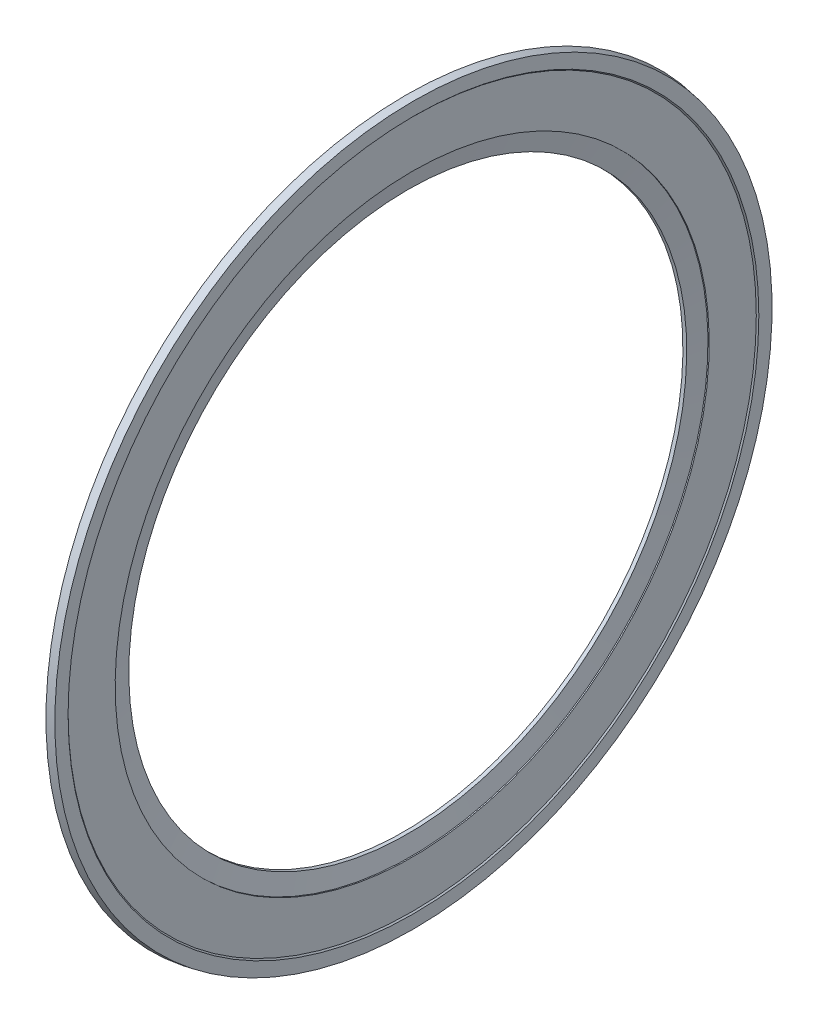
ISO-10303-21;
HEADER;
FILE_DESCRIPTION(('STEP AP214'),'2;1');
FILE_NAME('part.step','',(''),(''),'','','');
FILE_SCHEMA(('AUTOMOTIVE_DESIGN { 1 0 10303 214 1 1 1 1 }'));
ENDSEC;
DATA;
#1=APPLICATION_CONTEXT('core data for automotive mechanical design processes');
#2=APPLICATION_PROTOCOL_DEFINITION('international standard','automotive_design',2000,#1);
#3=PRODUCT_CONTEXT('',#1,'mechanical');
#4=PRODUCT('Part','Part','',(#3));
#5=PRODUCT_RELATED_PRODUCT_CATEGORY('part','',(#4));
#6=PRODUCT_DEFINITION_FORMATION('','',#4);
#7=PRODUCT_DEFINITION_CONTEXT('part definition',#1,'design');
#8=PRODUCT_DEFINITION('design','',#6,#7);
#9=PRODUCT_DEFINITION_SHAPE('','',#8);
#10=(LENGTH_UNIT() NAMED_UNIT(*) SI_UNIT(.MILLI.,.METRE.));
#11=(NAMED_UNIT(*) PLANE_ANGLE_UNIT() SI_UNIT($,.RADIAN.));
#12=(NAMED_UNIT(*) SI_UNIT($,.STERADIAN.) SOLID_ANGLE_UNIT());
#13=UNCERTAINTY_MEASURE_WITH_UNIT(LENGTH_MEASURE(1.E-05),#10,'distance_accuracy_value','');
#14=(GEOMETRIC_REPRESENTATION_CONTEXT(3) GLOBAL_UNCERTAINTY_ASSIGNED_CONTEXT((#13)) GLOBAL_UNIT_ASSIGNED_CONTEXT((#10,
#11,#12)) REPRESENTATION_CONTEXT('',''));
#15=CARTESIAN_POINT('',(0.,0.,0.));
#16=DIRECTION('',(0.,0.,1.));
#17=DIRECTION('',(1.,0.,0.));
#18=AXIS2_PLACEMENT_3D('',#15,#16,#17);
#19=CARTESIAN_POINT('',(0.17,11.9895505867204,0.));
#20=DIRECTION('',(-1.,0.,0.));
#21=DIRECTION('',(0.,-1.,0.));
#22=AXIS2_PLACEMENT_3D('',#19,#20,#21);
#23=PLANE('',#22);
#24=CARTESIAN_POINT('',(0.17,0.,0.));
#25=DIRECTION('',(1.,0.,0.));
#26=DIRECTION('',(0.,1.,0.));
#27=AXIS2_PLACEMENT_3D('',#24,#25,#26);
#28=CIRCLE('',#27,11.8620505867204);
#29=CARTESIAN_POINT('',(0.17,11.8620505867204,0.));
#30=VERTEX_POINT('',#29);
#31=EDGE_CURVE('E11',#30,#30,#28,.T.);
#32=ORIENTED_EDGE('',*,*,#31,.T.);
#33=EDGE_LOOP('',(#32));
#34=FACE_BOUND('',#33,.T.);
#35=CARTESIAN_POINT('',(0.17,0.,0.));
#36=DIRECTION('',(1.,0.,0.));
#37=DIRECTION('',(0.,1.,0.));
#38=AXIS2_PLACEMENT_3D('',#35,#36,#37);
#39=CIRCLE('',#38,12.1170505867204);
#40=CARTESIAN_POINT('',(0.17,12.1170505867204,0.));
#41=VERTEX_POINT('',#40);
#42=EDGE_CURVE('E80',#41,#41,#39,.T.);
#43=ORIENTED_EDGE('',*,*,#42,.F.);
#44=EDGE_LOOP('',(#43));
#45=FACE_BOUND('',#44,.T.);
#46=ADVANCED_FACE('F16',(#34,#45),#23,.T.);
#47=CARTESIAN_POINT('',(0.1275,0.,0.));
#48=DIRECTION('',(1.,0.,0.));
#49=DIRECTION('',(0.,1.,0.));
#50=AXIS2_PLACEMENT_3D('',#47,#48,#49);
#51=CONICAL_SURFACE('',#50,11.8195505867204,0.785398163397441);
#52=CARTESIAN_POINT('',(0.085,0.,0.));
#53=DIRECTION('',(1.,0.,0.));
#54=DIRECTION('',(0.,1.,0.));
#55=AXIS2_PLACEMENT_3D('',#52,#53,#54);
#56=CIRCLE('',#55,11.7770505867204);
#57=CARTESIAN_POINT('',(0.085,11.7770505867204,0.));
#58=VERTEX_POINT('',#57);
#59=EDGE_CURVE('E26',#58,#58,#56,.T.);
#60=ORIENTED_EDGE('',*,*,#59,.T.);
#61=EDGE_LOOP('',(#60));
#62=FACE_BOUND('',#61,.T.);
#63=ORIENTED_EDGE('',*,*,#31,.F.);
#64=EDGE_LOOP('',(#63));
#65=FACE_BOUND('',#64,.T.);
#66=ADVANCED_FACE('F103',(#62,#65),#51,.T.);
#67=CARTESIAN_POINT('',(0.085,10.8880252933602,0.));
#68=DIRECTION('',(-1.,0.,0.));
#69=DIRECTION('',(0.,-1.,0.));
#70=AXIS2_PLACEMENT_3D('',#67,#68,#69);
#71=PLANE('',#70);
#72=CARTESIAN_POINT('',(0.085,0.,0.));
#73=DIRECTION('',(1.,0.,0.));
#74=DIRECTION('',(0.,1.,0.));
#75=AXIS2_PLACEMENT_3D('',#72,#73,#74);
#76=CIRCLE('',#75,9.999);
#77=CARTESIAN_POINT('',(0.085,9.999,0.));
#78=VERTEX_POINT('',#77);
#79=EDGE_CURVE('E74',#78,#78,#76,.T.);
#80=ORIENTED_EDGE('',*,*,#79,.T.);
#81=EDGE_LOOP('',(#80));
#82=FACE_BOUND('',#81,.T.);
#83=ORIENTED_EDGE('',*,*,#59,.F.);
#84=EDGE_LOOP('',(#83));
#85=FACE_BOUND('',#84,.T.);
#86=ADVANCED_FACE('F88',(#82,#85),#71,.T.);
#87=CARTESIAN_POINT('',(0.143325944647351,0.,0.));
#88=DIRECTION('',(-1.,0.,0.));
#89=DIRECTION('',(0.,1.,0.));
#90=AXIS2_PLACEMENT_3D('',#87,#88,#89);
#91=CONICAL_SURFACE('',#90,9.96532550015711,0.523598775598287);
#92=CARTESIAN_POINT('',(0.201651889294703,0.,0.));
#93=DIRECTION('',(1.,0.,0.));
#94=DIRECTION('',(0.,1.,0.));
#95=AXIS2_PLACEMENT_3D('',#92,#93,#94);
#96=CIRCLE('',#95,9.93165100031423);
#97=CARTESIAN_POINT('',(0.201651889294703,9.93165100031423,0.));
#98=VERTEX_POINT('',#97);
#99=EDGE_CURVE('E76',#98,#98,#96,.T.);
#100=ORIENTED_EDGE('',*,*,#99,.T.);
#101=EDGE_LOOP('',(#100));
#102=FACE_BOUND('',#101,.T.);
#103=ORIENTED_EDGE('',*,*,#79,.F.);
#104=EDGE_LOOP('',(#103));
#105=FACE_BOUND('',#104,.T.);
#106=ADVANCED_FACE('F91',(#102,#105),#91,.F.);
#107=CARTESIAN_POINT('',(0.153950944647351,0.,0.));
#108=DIRECTION('',(1.,0.,0.));
#109=DIRECTION('',(0.,1.,0.));
#110=AXIS2_PLACEMENT_3D('',#107,#108,#109);
#111=CONICAL_SURFACE('',#110,9.66112550015711,1.39626340159546);
#112=CARTESIAN_POINT('',(0.10625,0.,0.));
#113=DIRECTION('',(1.,0.,0.));
#114=DIRECTION('',(0.,1.,0.));
#115=AXIS2_PLACEMENT_3D('',#112,#113,#114);
#116=CIRCLE('',#115,9.3906);
#117=CARTESIAN_POINT('',(0.10625,9.3906,0.));
#118=VERTEX_POINT('',#117);
#119=EDGE_CURVE('E69',#118,#118,#116,.T.);
#120=ORIENTED_EDGE('',*,*,#119,.T.);
#121=EDGE_LOOP('',(#120));
#122=FACE_BOUND('',#121,.T.);
#123=ORIENTED_EDGE('',*,*,#99,.F.);
#124=EDGE_LOOP('',(#123));
#125=FACE_BOUND('',#124,.T.);
#126=ADVANCED_FACE('F93',(#122,#125),#111,.T.);
#127=CARTESIAN_POINT('',(0.17,0.,0.));
#128=DIRECTION('',(-1.,0.,0.));
#129=DIRECTION('',(0.,1.,0.));
#130=AXIS2_PLACEMENT_3D('',#127,#128,#129);
#131=CYLINDRICAL_SURFACE('',#130,9.3906);
#132=CARTESIAN_POINT('',(0.23375,0.,0.));
#133=DIRECTION('',(1.,0.,0.));
#134=DIRECTION('',(0.,1.,0.));
#135=AXIS2_PLACEMENT_3D('',#132,#133,#134);
#136=CIRCLE('',#135,9.3906);
#137=CARTESIAN_POINT('',(0.23375,9.3906,0.));
#138=VERTEX_POINT('',#137);
#139=EDGE_CURVE('E60',#138,#138,#136,.T.);
#140=ORIENTED_EDGE('',*,*,#139,.T.);
#141=EDGE_LOOP('',(#140));
#142=FACE_BOUND('',#141,.T.);
#143=ORIENTED_EDGE('',*,*,#119,.F.);
#144=EDGE_LOOP('',(#143));
#145=FACE_BOUND('',#144,.T.);
#146=ADVANCED_FACE('F101',(#142,#145),#131,.F.);
#147=CARTESIAN_POINT('',(0.287388667531515,0.,0.));
#148=DIRECTION('',(1.,0.,0.));
#149=DIRECTION('',(0.,1.,0.));
#150=AXIS2_PLACEMENT_3D('',#147,#148,#149);
#151=CONICAL_SURFACE('',#150,9.6948,1.39626340159546);
#152=CARTESIAN_POINT('',(0.34102733506303,0.,0.));
#153=DIRECTION('',(1.,0.,0.));
#154=DIRECTION('',(0.,1.,0.));
#155=AXIS2_PLACEMENT_3D('',#152,#153,#154);
#156=CIRCLE('',#155,9.999);
#157=CARTESIAN_POINT('',(0.34102733506303,9.999,0.));
#158=VERTEX_POINT('',#157);
#159=EDGE_CURVE('E64',#158,#158,#156,.T.);
#160=ORIENTED_EDGE('',*,*,#159,.T.);
#161=EDGE_LOOP('',(#160));
#162=FACE_BOUND('',#161,.T.);
#163=ORIENTED_EDGE('',*,*,#139,.F.);
#164=EDGE_LOOP('',(#163));
#165=FACE_BOUND('',#164,.T.);
#166=ADVANCED_FACE('F65',(#162,#165),#151,.F.);
#167=CARTESIAN_POINT('',(0.361763667531515,0.,0.));
#168=DIRECTION('',(-1.,0.,0.));
#169=DIRECTION('',(0.,1.,0.));
#170=AXIS2_PLACEMENT_3D('',#167,#168,#169);
#171=CYLINDRICAL_SURFACE('',#170,9.999);
#172=CARTESIAN_POINT('',(0.3825,0.,0.));
#173=DIRECTION('',(1.,0.,0.));
#174=DIRECTION('',(0.,1.,0.));
#175=AXIS2_PLACEMENT_3D('',#172,#173,#174);
#176=CIRCLE('',#175,9.999);
#177=CARTESIAN_POINT('',(0.3825,9.999,0.));
#178=VERTEX_POINT('',#177);
#179=EDGE_CURVE('E20',#178,#178,#176,.T.);
#180=ORIENTED_EDGE('',*,*,#179,.T.);
#181=EDGE_LOOP('',(#180));
#182=FACE_BOUND('',#181,.T.);
#183=ORIENTED_EDGE('',*,*,#159,.F.);
#184=EDGE_LOOP('',(#183));
#185=FACE_BOUND('',#184,.T.);
#186=ADVANCED_FACE('F122',(#182,#185),#171,.F.);
#187=CARTESIAN_POINT('',(0.3825,10.7916,0.));
#188=DIRECTION('',(1.,0.,0.));
#189=DIRECTION('',(0.,1.,0.));
#190=AXIS2_PLACEMENT_3D('',#187,#188,#189);
#191=PLANE('',#190);
#192=CARTESIAN_POINT('',(0.3825,0.,0.));
#193=DIRECTION('',(1.,0.,0.));
#194=DIRECTION('',(0.,1.,0.));
#195=AXIS2_PLACEMENT_3D('',#192,#193,#194);
#196=CIRCLE('',#195,11.5842);
#197=CARTESIAN_POINT('',(0.3825,11.5842,0.));
#198=VERTEX_POINT('',#197);
#199=EDGE_CURVE('E71',#198,#198,#196,.T.);
#200=ORIENTED_EDGE('',*,*,#199,.T.);
#201=EDGE_LOOP('',(#200));
#202=FACE_BOUND('',#201,.T.);
#203=ORIENTED_EDGE('',*,*,#179,.F.);
#204=EDGE_LOOP('',(#203));
#205=FACE_BOUND('',#204,.T.);
#206=ADVANCED_FACE('F124',(#202,#205),#191,.T.);
#207=CARTESIAN_POINT('',(0.40375,0.,0.));
#208=DIRECTION('',(1.,0.,0.));
#209=DIRECTION('',(0.,1.,0.));
#210=AXIS2_PLACEMENT_3D('',#207,#208,#209);
#211=CONICAL_SURFACE('',#210,11.60545,0.785398163397428);
#212=CARTESIAN_POINT('',(0.425,0.,0.));
#213=DIRECTION('',(1.,0.,0.));
#214=DIRECTION('',(0.,1.,0.));
#215=AXIS2_PLACEMENT_3D('',#212,#213,#214);
#216=CIRCLE('',#215,11.6267);
#217=CARTESIAN_POINT('',(0.425,11.6267,0.));
#218=VERTEX_POINT('',#217);
#219=EDGE_CURVE('E78',#218,#218,#216,.T.);
#220=ORIENTED_EDGE('',*,*,#219,.T.);
#221=EDGE_LOOP('',(#220));
#222=FACE_BOUND('',#221,.T.);
#223=ORIENTED_EDGE('',*,*,#199,.F.);
#224=EDGE_LOOP('',(#223));
#225=FACE_BOUND('',#224,.T.);
#226=ADVANCED_FACE('F18',(#222,#225),#211,.F.);
#227=CARTESIAN_POINT('',(0.425,11.8493936033199,0.));
#228=DIRECTION('',(1.,0.,0.));
#229=DIRECTION('',(0.,1.,0.));
#230=AXIS2_PLACEMENT_3D('',#227,#228,#229);
#231=PLANE('',#230);
#232=CARTESIAN_POINT('',(0.425,0.,0.));
#233=DIRECTION('',(1.,0.,0.));
#234=DIRECTION('',(0.,1.,0.));
#235=AXIS2_PLACEMENT_3D('',#232,#233,#234);
#236=CIRCLE('',#235,12.0720872066398);
#237=CARTESIAN_POINT('',(0.425,12.0720872066398,0.));
#238=VERTEX_POINT('',#237);
#239=EDGE_CURVE('E82',#238,#238,#236,.T.);
#240=ORIENTED_EDGE('',*,*,#239,.T.);
#241=EDGE_LOOP('',(#240));
#242=FACE_BOUND('',#241,.T.);
#243=ORIENTED_EDGE('',*,*,#219,.F.);
#244=EDGE_LOOP('',(#243));
#245=FACE_BOUND('',#244,.T.);
#246=ADVANCED_FACE('F118',(#242,#245),#231,.T.);
#247=CARTESIAN_POINT('',(0.2975,0.,0.));
#248=DIRECTION('',(-1.,0.,0.));
#249=DIRECTION('',(0.,1.,0.));
#250=AXIS2_PLACEMENT_3D('',#247,#248,#249);
#251=CONICAL_SURFACE('',#250,12.0945688966801,0.174532925199431);
#252=ORIENTED_EDGE('',*,*,#42,.T.);
#253=EDGE_LOOP('',(#252));
#254=FACE_BOUND('',#253,.T.);
#255=ORIENTED_EDGE('',*,*,#239,.F.);
#256=EDGE_LOOP('',(#255));
#257=FACE_BOUND('',#256,.T.);
#258=ADVANCED_FACE('F115',(#254,#257),#251,.T.);
#259=CLOSED_SHELL('',(#46,#66,#86,#106,#126,#146,#166,#186,#206,#226,#246,#258));
#260=MANIFOLD_SOLID_BREP('B1',#259);
#261=ADVANCED_BREP_SHAPE_REPRESENTATION('',(#18,#260),#14);
#262=SHAPE_DEFINITION_REPRESENTATION(#9,#261);
ENDSEC;
END-ISO-10303-21;
